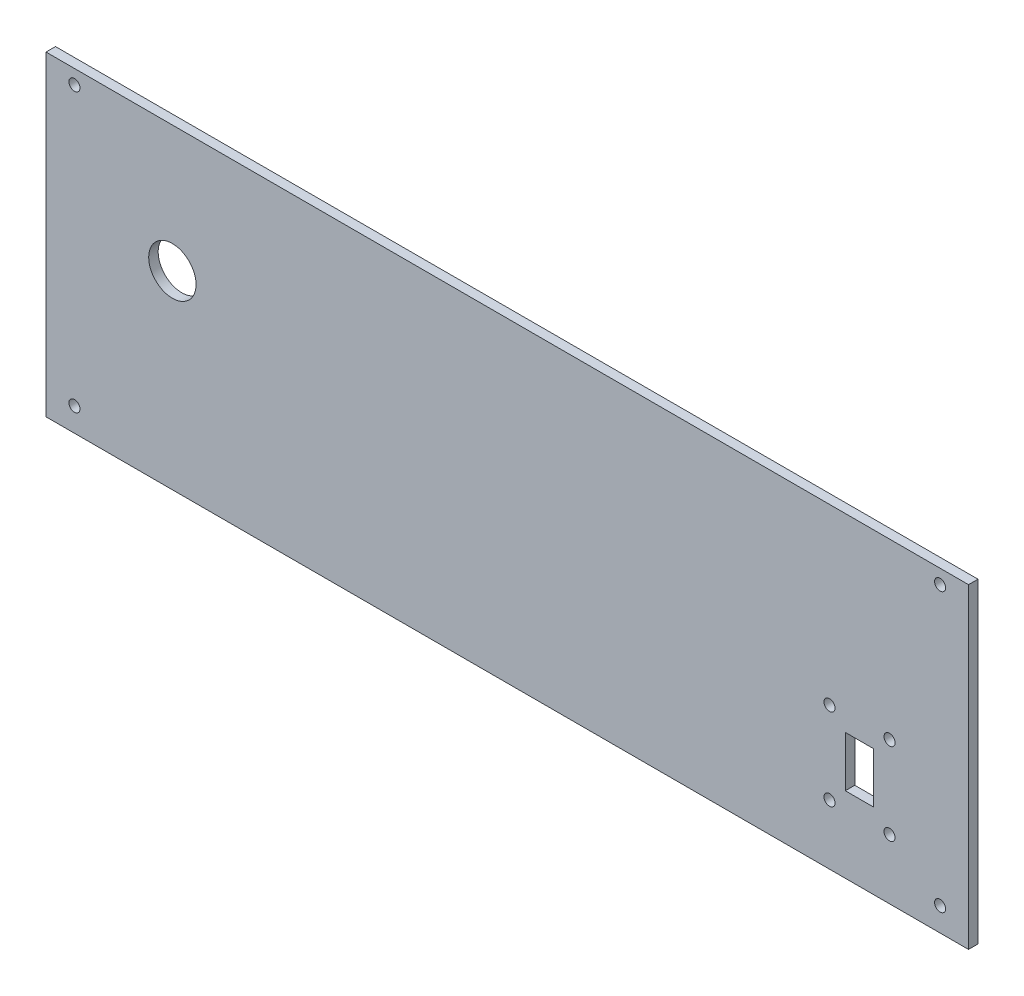
ISO-10303-21;
HEADER;
FILE_DESCRIPTION(('STEP AP214'),'2;1');
FILE_NAME('part.step','',(''),(''),'','','');
FILE_SCHEMA(('AUTOMOTIVE_DESIGN { 1 0 10303 214 1 1 1 1 }'));
ENDSEC;
DATA;
#1=APPLICATION_CONTEXT('core data for automotive mechanical design processes');
#2=APPLICATION_PROTOCOL_DEFINITION('international standard','automotive_design',2000,#1);
#3=PRODUCT_CONTEXT('',#1,'mechanical');
#4=PRODUCT('Part','Part','',(#3));
#5=PRODUCT_RELATED_PRODUCT_CATEGORY('part','',(#4));
#6=PRODUCT_DEFINITION_FORMATION('','',#4);
#7=PRODUCT_DEFINITION_CONTEXT('part definition',#1,'design');
#8=PRODUCT_DEFINITION('design','',#6,#7);
#9=PRODUCT_DEFINITION_SHAPE('','',#8);
#10=(LENGTH_UNIT() NAMED_UNIT(*) SI_UNIT(.MILLI.,.METRE.));
#11=(NAMED_UNIT(*) PLANE_ANGLE_UNIT() SI_UNIT($,.RADIAN.));
#12=(NAMED_UNIT(*) SI_UNIT($,.STERADIAN.) SOLID_ANGLE_UNIT());
#13=UNCERTAINTY_MEASURE_WITH_UNIT(LENGTH_MEASURE(1.E-05),#10,'distance_accuracy_value','');
#14=(GEOMETRIC_REPRESENTATION_CONTEXT(3) GLOBAL_UNCERTAINTY_ASSIGNED_CONTEXT((#13)) GLOBAL_UNIT_ASSIGNED_CONTEXT((#10,
#11,#12)) REPRESENTATION_CONTEXT('',''));
#15=CARTESIAN_POINT('',(0.,0.,0.));
#16=DIRECTION('',(0.,0.,1.));
#17=DIRECTION('',(1.,0.,0.));
#18=AXIS2_PLACEMENT_3D('',#15,#16,#17);
#19=CARTESIAN_POINT('',(0.,0.,3.));
#20=DIRECTION('',(0.,1.,0.));
#21=DIRECTION('',(0.,0.,1.));
#22=AXIS2_PLACEMENT_3D('',#19,#20,#21);
#23=PLANE('',#22);
#24=DIRECTION('',(1.,0.,0.));
#25=VECTOR('',#24,1.);
#26=CARTESIAN_POINT('',(0.,0.,3.));
#27=LINE('',#26,#25);
#28=CARTESIAN_POINT('',(7.99999999999999,0.,3.));
#29=VERTEX_POINT('',#28);
#30=CARTESIAN_POINT('',(300.,0.,3.));
#31=VERTEX_POINT('',#30);
#32=EDGE_CURVE('E177',#29,#31,#27,.T.);
#33=ORIENTED_EDGE('',*,*,#32,.F.);
#34=DIRECTION('',(0.,0.,-1.));
#35=VECTOR('',#34,1.);
#36=CARTESIAN_POINT('',(7.99999999999999,0.,10.));
#37=LINE('',#36,#35);
#38=CARTESIAN_POINT('',(7.99999999999999,0.,0.));
#39=VERTEX_POINT('',#38);
#40=EDGE_CURVE('E169',#29,#39,#37,.T.);
#41=ORIENTED_EDGE('',*,*,#40,.T.);
#42=DIRECTION('',(1.,0.,0.));
#43=VECTOR('',#42,1.);
#44=CARTESIAN_POINT('',(0.,0.,0.));
#45=LINE('',#44,#43);
#46=CARTESIAN_POINT('',(300.,0.,0.));
#47=VERTEX_POINT('',#46);
#48=EDGE_CURVE('E176',#39,#47,#45,.T.);
#49=ORIENTED_EDGE('',*,*,#48,.T.);
#50=DIRECTION('',(0.,0.,-1.));
#51=VECTOR('',#50,1.);
#52=CARTESIAN_POINT('',(300.,0.,3.));
#53=LINE('',#52,#51);
#54=EDGE_CURVE('E11',#31,#47,#53,.T.);
#55=ORIENTED_EDGE('',*,*,#54,.F.);
#56=EDGE_LOOP('',(#33,#41,#49,#55));
#57=FACE_BOUND('',#56,.T.);
#58=ADVANCED_FACE('F35',(#57),#23,.F.);
#59=CARTESIAN_POINT('',(300.,0.,3.));
#60=DIRECTION('',(-1.,0.,0.));
#61=DIRECTION('',(0.,0.,1.));
#62=AXIS2_PLACEMENT_3D('',#59,#60,#61);
#63=PLANE('',#62);
#64=DIRECTION('',(0.,1.,0.));
#65=VECTOR('',#64,1.);
#66=CARTESIAN_POINT('',(300.,0.,0.));
#67=LINE('',#66,#65);
#68=CARTESIAN_POINT('',(300.,100.,0.));
#69=VERTEX_POINT('',#68);
#70=EDGE_CURVE('E186',#47,#69,#67,.T.);
#71=ORIENTED_EDGE('',*,*,#70,.T.);
#72=DIRECTION('',(0.,0.,-1.));
#73=VECTOR('',#72,1.);
#74=CARTESIAN_POINT('',(300.,100.,3.));
#75=LINE('',#74,#73);
#76=CARTESIAN_POINT('',(300.,100.,3.));
#77=VERTEX_POINT('',#76);
#78=EDGE_CURVE('E42',#77,#69,#75,.T.);
#79=ORIENTED_EDGE('',*,*,#78,.F.);
#80=DIRECTION('',(0.,1.,0.));
#81=VECTOR('',#80,1.);
#82=CARTESIAN_POINT('',(300.,0.,3.));
#83=LINE('',#82,#81);
#84=EDGE_CURVE('E179',#31,#77,#83,.T.);
#85=ORIENTED_EDGE('',*,*,#84,.F.);
#86=ORIENTED_EDGE('',*,*,#54,.T.);
#87=EDGE_LOOP('',(#71,#79,#85,#86));
#88=FACE_BOUND('',#87,.T.);
#89=ADVANCED_FACE('F209',(#88),#63,.F.);
#90=CARTESIAN_POINT('',(0.,100.,3.));
#91=DIRECTION('',(0.,-1.,0.));
#92=DIRECTION('',(0.,0.,-1.));
#93=AXIS2_PLACEMENT_3D('',#90,#91,#92);
#94=PLANE('',#93);
#95=DIRECTION('',(-1.,0.,0.));
#96=VECTOR('',#95,1.);
#97=CARTESIAN_POINT('',(0.,100.,0.));
#98=LINE('',#97,#96);
#99=CARTESIAN_POINT('',(8.,100.,0.));
#100=VERTEX_POINT('',#99);
#101=EDGE_CURVE('E180',#69,#100,#98,.T.);
#102=ORIENTED_EDGE('',*,*,#101,.T.);
#103=DIRECTION('',(0.,0.,-1.));
#104=VECTOR('',#103,1.);
#105=CARTESIAN_POINT('',(8.,100.,10.));
#106=LINE('',#105,#104);
#107=CARTESIAN_POINT('',(8.,100.,3.));
#108=VERTEX_POINT('',#107);
#109=EDGE_CURVE('E168',#108,#100,#106,.T.);
#110=ORIENTED_EDGE('',*,*,#109,.F.);
#111=DIRECTION('',(-1.,0.,0.));
#112=VECTOR('',#111,1.);
#113=CARTESIAN_POINT('',(0.,100.,3.));
#114=LINE('',#113,#112);
#115=EDGE_CURVE('E182',#77,#108,#114,.T.);
#116=ORIENTED_EDGE('',*,*,#115,.F.);
#117=ORIENTED_EDGE('',*,*,#78,.T.);
#118=EDGE_LOOP('',(#102,#110,#116,#117));
#119=FACE_BOUND('',#118,.T.);
#120=ADVANCED_FACE('F194',(#119),#94,.F.);
#121=CARTESIAN_POINT('',(0.,0.,3.));
#122=DIRECTION('',(0.,0.,-1.));
#123=DIRECTION('',(-1.,0.,0.));
#124=AXIS2_PLACEMENT_3D('',#121,#122,#123);
#125=PLANE('',#124);
#126=CARTESIAN_POINT('',(275.,45.,3.));
#127=DIRECTION('',(0.,0.,-1.));
#128=DIRECTION('',(-1.,0.,0.));
#129=AXIS2_PLACEMENT_3D('',#126,#127,#128);
#130=CIRCLE('',#129,1.74999999999998);
#131=CARTESIAN_POINT('',(273.25,45.,3.));
#132=VERTEX_POINT('',#131);
#133=EDGE_CURVE('E279',#132,#132,#130,.T.);
#134=ORIENTED_EDGE('',*,*,#133,.T.);
#135=EDGE_LOOP('',(#134));
#136=FACE_BOUND('',#135,.T.);
#137=CARTESIAN_POINT('',(275.,19.,3.));
#138=DIRECTION('',(0.,0.,-1.));
#139=DIRECTION('',(-1.,0.,0.));
#140=AXIS2_PLACEMENT_3D('',#137,#138,#139);
#141=CIRCLE('',#140,1.74999999999998);
#142=CARTESIAN_POINT('',(273.25,19.,3.));
#143=VERTEX_POINT('',#142);
#144=EDGE_CURVE('E280',#143,#143,#141,.T.);
#145=ORIENTED_EDGE('',*,*,#144,.T.);
#146=EDGE_LOOP('',(#145));
#147=FACE_BOUND('',#146,.T.);
#148=CARTESIAN_POINT('',(256.,19.,3.));
#149=DIRECTION('',(0.,0.,-1.));
#150=DIRECTION('',(-1.,0.,0.));
#151=AXIS2_PLACEMENT_3D('',#148,#149,#150);
#152=CIRCLE('',#151,1.74999999999998);
#153=CARTESIAN_POINT('',(254.25,19.,3.));
#154=VERTEX_POINT('',#153);
#155=EDGE_CURVE('E283',#154,#154,#152,.T.);
#156=ORIENTED_EDGE('',*,*,#155,.T.);
#157=EDGE_LOOP('',(#156));
#158=FACE_BOUND('',#157,.T.);
#159=CARTESIAN_POINT('',(256.,45.,3.));
#160=DIRECTION('',(0.,0.,-1.));
#161=DIRECTION('',(-1.,0.,0.));
#162=AXIS2_PLACEMENT_3D('',#159,#160,#161);
#163=CIRCLE('',#162,1.74999999999998);
#164=CARTESIAN_POINT('',(254.25,45.,3.));
#165=VERTEX_POINT('',#164);
#166=EDGE_CURVE('E288',#165,#165,#163,.T.);
#167=ORIENTED_EDGE('',*,*,#166,.T.);
#168=EDGE_LOOP('',(#167));
#169=FACE_BOUND('',#168,.T.);
#170=DIRECTION('',(-1.,0.,0.));
#171=VECTOR('',#170,1.);
#172=CARTESIAN_POINT('',(0.,24.,3.));
#173=LINE('',#172,#171);
#174=CARTESIAN_POINT('',(270.,24.,3.));
#175=VERTEX_POINT('',#174);
#176=CARTESIAN_POINT('',(261.,24.,3.));
#177=VERTEX_POINT('',#176);
#178=EDGE_CURVE('E130',#175,#177,#173,.T.);
#179=ORIENTED_EDGE('',*,*,#178,.T.);
#180=DIRECTION('',(0.,1.,0.));
#181=VECTOR('',#180,1.);
#182=CARTESIAN_POINT('',(261.,0.,3.));
#183=LINE('',#182,#181);
#184=CARTESIAN_POINT('',(261.,40.,3.));
#185=VERTEX_POINT('',#184);
#186=EDGE_CURVE('E133',#177,#185,#183,.T.);
#187=ORIENTED_EDGE('',*,*,#186,.T.);
#188=DIRECTION('',(1.,0.,0.));
#189=VECTOR('',#188,1.);
#190=CARTESIAN_POINT('',(0.,40.,3.));
#191=LINE('',#190,#189);
#192=CARTESIAN_POINT('',(270.,40.,3.));
#193=VERTEX_POINT('',#192);
#194=EDGE_CURVE('E125',#185,#193,#191,.T.);
#195=ORIENTED_EDGE('',*,*,#194,.T.);
#196=DIRECTION('',(0.,-1.,0.));
#197=VECTOR('',#196,1.);
#198=CARTESIAN_POINT('',(270.,0.,3.));
#199=LINE('',#198,#197);
#200=EDGE_CURVE('E105',#193,#175,#199,.T.);
#201=ORIENTED_EDGE('',*,*,#200,.T.);
#202=EDGE_LOOP('',(#179,#187,#195,#201));
#203=FACE_BOUND('',#202,.T.);
#204=CARTESIAN_POINT('',(48.,60.,3.));
#205=DIRECTION('',(0.,0.,-1.));
#206=DIRECTION('',(-1.,0.,0.));
#207=AXIS2_PLACEMENT_3D('',#204,#205,#206);
#208=CIRCLE('',#207,7.5);
#209=CARTESIAN_POINT('',(40.5,60.,3.));
#210=VERTEX_POINT('',#209);
#211=EDGE_CURVE('E139',#210,#210,#208,.T.);
#212=ORIENTED_EDGE('',*,*,#211,.T.);
#213=EDGE_LOOP('',(#212));
#214=FACE_BOUND('',#213,.T.);
#215=CARTESIAN_POINT('',(17.,95.5,3.));
#216=DIRECTION('',(0.,0.,-1.));
#217=DIRECTION('',(1.,0.,0.));
#218=AXIS2_PLACEMENT_3D('',#215,#216,#217);
#219=CIRCLE('',#218,1.74999999999998);
#220=CARTESIAN_POINT('',(18.75,95.5,3.));
#221=VERTEX_POINT('',#220);
#222=EDGE_CURVE('E143',#221,#221,#219,.T.);
#223=ORIENTED_EDGE('',*,*,#222,.T.);
#224=EDGE_LOOP('',(#223));
#225=FACE_BOUND('',#224,.T.);
#226=CARTESIAN_POINT('',(17.,7.49999999999998,3.));
#227=DIRECTION('',(0.,0.,-1.));
#228=DIRECTION('',(-1.,0.,0.));
#229=AXIS2_PLACEMENT_3D('',#226,#227,#228);
#230=CIRCLE('',#229,1.74999999999998);
#231=CARTESIAN_POINT('',(15.25,7.49999999999998,3.));
#232=VERTEX_POINT('',#231);
#233=EDGE_CURVE('E150',#232,#232,#230,.T.);
#234=ORIENTED_EDGE('',*,*,#233,.T.);
#235=EDGE_LOOP('',(#234));
#236=FACE_BOUND('',#235,.T.);
#237=CARTESIAN_POINT('',(291.,7.49999999999994,3.));
#238=DIRECTION('',(0.,0.,-1.));
#239=DIRECTION('',(1.,0.,0.));
#240=AXIS2_PLACEMENT_3D('',#237,#238,#239);
#241=CIRCLE('',#240,1.74999999999998);
#242=CARTESIAN_POINT('',(292.75,7.49999999999994,3.));
#243=VERTEX_POINT('',#242);
#244=EDGE_CURVE('E156',#243,#243,#241,.T.);
#245=ORIENTED_EDGE('',*,*,#244,.T.);
#246=EDGE_LOOP('',(#245));
#247=FACE_BOUND('',#246,.T.);
#248=CARTESIAN_POINT('',(291.,95.5,3.));
#249=DIRECTION('',(0.,0.,-1.));
#250=DIRECTION('',(-1.,0.,0.));
#251=AXIS2_PLACEMENT_3D('',#248,#249,#250);
#252=CIRCLE('',#251,1.74999999999998);
#253=CARTESIAN_POINT('',(289.25,95.5,3.));
#254=VERTEX_POINT('',#253);
#255=EDGE_CURVE('E161',#254,#254,#252,.T.);
#256=ORIENTED_EDGE('',*,*,#255,.T.);
#257=EDGE_LOOP('',(#256));
#258=FACE_BOUND('',#257,.T.);
#259=ORIENTED_EDGE('',*,*,#115,.T.);
#260=DIRECTION('',(0.,-1.,0.));
#261=VECTOR('',#260,1.);
#262=CARTESIAN_POINT('',(7.99999999999999,0.,3.));
#263=LINE('',#262,#261);
#264=EDGE_CURVE('E172',#108,#29,#263,.T.);
#265=ORIENTED_EDGE('',*,*,#264,.T.);
#266=ORIENTED_EDGE('',*,*,#32,.T.);
#267=ORIENTED_EDGE('',*,*,#84,.T.);
#268=EDGE_LOOP('',(#259,#265,#266,#267));
#269=FACE_BOUND('',#268,.T.);
#270=ADVANCED_FACE('F208',(#136,#147,#158,#169,#203,#214,#225,#236,#247,#258,#269),#125,.F.);
#271=CARTESIAN_POINT('',(0.,0.,0.));
#272=DIRECTION('',(0.,0.,-1.));
#273=DIRECTION('',(-1.,0.,0.));
#274=AXIS2_PLACEMENT_3D('',#271,#272,#273);
#275=PLANE('',#274);
#276=CARTESIAN_POINT('',(275.,45.,0.));
#277=DIRECTION('',(0.,0.,-1.));
#278=DIRECTION('',(-1.,0.,0.));
#279=AXIS2_PLACEMENT_3D('',#276,#277,#278);
#280=CIRCLE('',#279,1.74999999999998);
#281=CARTESIAN_POINT('',(273.25,45.,0.));
#282=VERTEX_POINT('',#281);
#283=EDGE_CURVE('E276',#282,#282,#280,.T.);
#284=ORIENTED_EDGE('',*,*,#283,.F.);
#285=EDGE_LOOP('',(#284));
#286=FACE_BOUND('',#285,.T.);
#287=CARTESIAN_POINT('',(275.,19.,0.));
#288=DIRECTION('',(0.,0.,-1.));
#289=DIRECTION('',(1.,0.,0.));
#290=AXIS2_PLACEMENT_3D('',#287,#288,#289);
#291=CIRCLE('',#290,1.74999999999998);
#292=CARTESIAN_POINT('',(276.75,19.,0.));
#293=VERTEX_POINT('',#292);
#294=EDGE_CURVE('E297',#293,#293,#291,.T.);
#295=ORIENTED_EDGE('',*,*,#294,.F.);
#296=EDGE_LOOP('',(#295));
#297=FACE_BOUND('',#296,.T.);
#298=CARTESIAN_POINT('',(256.,19.,0.));
#299=DIRECTION('',(0.,0.,-1.));
#300=DIRECTION('',(-1.,0.,0.));
#301=AXIS2_PLACEMENT_3D('',#298,#299,#300);
#302=CIRCLE('',#301,1.74999999999998);
#303=CARTESIAN_POINT('',(254.25,19.,0.));
#304=VERTEX_POINT('',#303);
#305=EDGE_CURVE('E294',#304,#304,#302,.T.);
#306=ORIENTED_EDGE('',*,*,#305,.F.);
#307=EDGE_LOOP('',(#306));
#308=FACE_BOUND('',#307,.T.);
#309=CARTESIAN_POINT('',(256.,45.,0.));
#310=DIRECTION('',(0.,0.,-1.));
#311=DIRECTION('',(1.,0.,0.));
#312=AXIS2_PLACEMENT_3D('',#309,#310,#311);
#313=CIRCLE('',#312,1.74999999999998);
#314=CARTESIAN_POINT('',(257.75,45.,0.));
#315=VERTEX_POINT('',#314);
#316=EDGE_CURVE('E291',#315,#315,#313,.T.);
#317=ORIENTED_EDGE('',*,*,#316,.F.);
#318=EDGE_LOOP('',(#317));
#319=FACE_BOUND('',#318,.T.);
#320=DIRECTION('',(0.,1.,0.));
#321=VECTOR('',#320,1.);
#322=CARTESIAN_POINT('',(261.,24.,0.));
#323=LINE('',#322,#321);
#324=CARTESIAN_POINT('',(261.,24.,0.));
#325=VERTEX_POINT('',#324);
#326=CARTESIAN_POINT('',(261.,40.,0.));
#327=VERTEX_POINT('',#326);
#328=EDGE_CURVE('E57',#325,#327,#323,.T.);
#329=ORIENTED_EDGE('',*,*,#328,.F.);
#330=DIRECTION('',(-1.,0.,0.));
#331=VECTOR('',#330,1.);
#332=CARTESIAN_POINT('',(261.,24.,0.));
#333=LINE('',#332,#331);
#334=CARTESIAN_POINT('',(270.,24.,0.));
#335=VERTEX_POINT('',#334);
#336=EDGE_CURVE('E118',#335,#325,#333,.T.);
#337=ORIENTED_EDGE('',*,*,#336,.F.);
#338=DIRECTION('',(0.,-1.,0.));
#339=VECTOR('',#338,1.);
#340=CARTESIAN_POINT('',(270.,24.,0.));
#341=LINE('',#340,#339);
#342=CARTESIAN_POINT('',(270.,40.,0.));
#343=VERTEX_POINT('',#342);
#344=EDGE_CURVE('E102',#343,#335,#341,.T.);
#345=ORIENTED_EDGE('',*,*,#344,.F.);
#346=DIRECTION('',(1.,0.,0.));
#347=VECTOR('',#346,1.);
#348=CARTESIAN_POINT('',(261.,40.,0.));
#349=LINE('',#348,#347);
#350=EDGE_CURVE('E111',#327,#343,#349,.T.);
#351=ORIENTED_EDGE('',*,*,#350,.F.);
#352=EDGE_LOOP('',(#329,#337,#345,#351));
#353=FACE_BOUND('',#352,.T.);
#354=CARTESIAN_POINT('',(48.,60.,0.));
#355=DIRECTION('',(0.,0.,-1.));
#356=DIRECTION('',(-1.,0.,0.));
#357=AXIS2_PLACEMENT_3D('',#354,#355,#356);
#358=CIRCLE('',#357,7.5);
#359=CARTESIAN_POINT('',(40.5,60.,0.));
#360=VERTEX_POINT('',#359);
#361=EDGE_CURVE('E136',#360,#360,#358,.T.);
#362=ORIENTED_EDGE('',*,*,#361,.F.);
#363=EDGE_LOOP('',(#362));
#364=FACE_BOUND('',#363,.T.);
#365=CARTESIAN_POINT('',(17.,95.5,0.));
#366=DIRECTION('',(0.,0.,-1.));
#367=DIRECTION('',(1.,0.,0.));
#368=AXIS2_PLACEMENT_3D('',#365,#366,#367);
#369=CIRCLE('',#368,1.74999999999998);
#370=CARTESIAN_POINT('',(18.75,95.5,0.));
#371=VERTEX_POINT('',#370);
#372=EDGE_CURVE('E147',#371,#371,#369,.T.);
#373=ORIENTED_EDGE('',*,*,#372,.F.);
#374=EDGE_LOOP('',(#373));
#375=FACE_BOUND('',#374,.T.);
#376=CARTESIAN_POINT('',(17.,7.49999999999998,0.));
#377=DIRECTION('',(0.,0.,-1.));
#378=DIRECTION('',(-1.,0.,0.));
#379=AXIS2_PLACEMENT_3D('',#376,#377,#378);
#380=CIRCLE('',#379,1.74999999999998);
#381=CARTESIAN_POINT('',(15.25,7.49999999999998,0.));
#382=VERTEX_POINT('',#381);
#383=EDGE_CURVE('E153',#382,#382,#380,.T.);
#384=ORIENTED_EDGE('',*,*,#383,.F.);
#385=EDGE_LOOP('',(#384));
#386=FACE_BOUND('',#385,.T.);
#387=CARTESIAN_POINT('',(291.,7.49999999999994,0.));
#388=DIRECTION('',(0.,0.,-1.));
#389=DIRECTION('',(1.,0.,0.));
#390=AXIS2_PLACEMENT_3D('',#387,#388,#389);
#391=CIRCLE('',#390,1.74999999999998);
#392=CARTESIAN_POINT('',(292.75,7.49999999999994,0.));
#393=VERTEX_POINT('',#392);
#394=EDGE_CURVE('E142',#393,#393,#391,.T.);
#395=ORIENTED_EDGE('',*,*,#394,.F.);
#396=EDGE_LOOP('',(#395));
#397=FACE_BOUND('',#396,.T.);
#398=CARTESIAN_POINT('',(291.,95.5,0.));
#399=DIRECTION('',(0.,0.,-1.));
#400=DIRECTION('',(-1.,0.,0.));
#401=AXIS2_PLACEMENT_3D('',#398,#399,#400);
#402=CIRCLE('',#401,1.74999999999998);
#403=CARTESIAN_POINT('',(289.25,95.5,0.));
#404=VERTEX_POINT('',#403);
#405=EDGE_CURVE('E146',#404,#404,#402,.T.);
#406=ORIENTED_EDGE('',*,*,#405,.F.);
#407=EDGE_LOOP('',(#406));
#408=FACE_BOUND('',#407,.T.);
#409=DIRECTION('',(0.,-1.,0.));
#410=VECTOR('',#409,1.);
#411=CARTESIAN_POINT('',(8.,100.,0.));
#412=LINE('',#411,#410);
#413=EDGE_CURVE('E164',#100,#39,#412,.T.);
#414=ORIENTED_EDGE('',*,*,#413,.F.);
#415=ORIENTED_EDGE('',*,*,#101,.F.);
#416=ORIENTED_EDGE('',*,*,#70,.F.);
#417=ORIENTED_EDGE('',*,*,#48,.F.);
#418=EDGE_LOOP('',(#414,#415,#416,#417));
#419=FACE_BOUND('',#418,.T.);
#420=ADVANCED_FACE('F115',(#286,#297,#308,#319,#353,#364,#375,#386,#397,#408,#419),#275,.T.);
#421=CARTESIAN_POINT('',(8.,100.,10.));
#422=DIRECTION('',(1.,0.,0.));
#423=DIRECTION('',(0.,1.,0.));
#424=AXIS2_PLACEMENT_3D('',#421,#422,#423);
#425=PLANE('',#424);
#426=ORIENTED_EDGE('',*,*,#109,.T.);
#427=ORIENTED_EDGE('',*,*,#413,.T.);
#428=ORIENTED_EDGE('',*,*,#40,.F.);
#429=ORIENTED_EDGE('',*,*,#264,.F.);
#430=EDGE_LOOP('',(#426,#427,#428,#429));
#431=FACE_BOUND('',#430,.T.);
#432=ADVANCED_FACE('F203',(#431),#425,.F.);
#433=CARTESIAN_POINT('',(291.,95.5,3.));
#434=DIRECTION('',(0.,0.,-1.));
#435=DIRECTION('',(-1.,0.,0.));
#436=AXIS2_PLACEMENT_3D('',#433,#434,#435);
#437=CYLINDRICAL_SURFACE('',#436,1.74999999999998);
#438=ORIENTED_EDGE('',*,*,#255,.F.);
#439=EDGE_LOOP('',(#438));
#440=FACE_BOUND('',#439,.T.);
#441=ORIENTED_EDGE('',*,*,#405,.T.);
#442=EDGE_LOOP('',(#441));
#443=FACE_BOUND('',#442,.T.);
#444=ADVANCED_FACE('F225',(#440,#443),#437,.F.);
#445=CARTESIAN_POINT('',(291.,7.49999999999994,3.));
#446=DIRECTION('',(0.,0.,-1.));
#447=DIRECTION('',(-1.,0.,0.));
#448=AXIS2_PLACEMENT_3D('',#445,#446,#447);
#449=CYLINDRICAL_SURFACE('',#448,1.74999999999998);
#450=ORIENTED_EDGE('',*,*,#244,.F.);
#451=EDGE_LOOP('',(#450));
#452=FACE_BOUND('',#451,.T.);
#453=ORIENTED_EDGE('',*,*,#394,.T.);
#454=EDGE_LOOP('',(#453));
#455=FACE_BOUND('',#454,.T.);
#456=ADVANCED_FACE('F228',(#452,#455),#449,.F.);
#457=CARTESIAN_POINT('',(17.,7.49999999999998,3.));
#458=DIRECTION('',(0.,0.,-1.));
#459=DIRECTION('',(-1.,0.,0.));
#460=AXIS2_PLACEMENT_3D('',#457,#458,#459);
#461=CYLINDRICAL_SURFACE('',#460,1.74999999999998);
#462=ORIENTED_EDGE('',*,*,#233,.F.);
#463=EDGE_LOOP('',(#462));
#464=FACE_BOUND('',#463,.T.);
#465=ORIENTED_EDGE('',*,*,#383,.T.);
#466=EDGE_LOOP('',(#465));
#467=FACE_BOUND('',#466,.T.);
#468=ADVANCED_FACE('F232',(#464,#467),#461,.F.);
#469=CARTESIAN_POINT('',(17.,95.5,3.));
#470=DIRECTION('',(0.,0.,-1.));
#471=DIRECTION('',(-1.,0.,0.));
#472=AXIS2_PLACEMENT_3D('',#469,#470,#471);
#473=CYLINDRICAL_SURFACE('',#472,1.74999999999998);
#474=ORIENTED_EDGE('',*,*,#222,.F.);
#475=EDGE_LOOP('',(#474));
#476=FACE_BOUND('',#475,.T.);
#477=ORIENTED_EDGE('',*,*,#372,.T.);
#478=EDGE_LOOP('',(#477));
#479=FACE_BOUND('',#478,.T.);
#480=ADVANCED_FACE('F236',(#476,#479),#473,.F.);
#481=CARTESIAN_POINT('',(48.,60.,10.));
#482=DIRECTION('',(0.,0.,-1.));
#483=DIRECTION('',(-1.,0.,0.));
#484=AXIS2_PLACEMENT_3D('',#481,#482,#483);
#485=CYLINDRICAL_SURFACE('',#484,7.5);
#486=ORIENTED_EDGE('',*,*,#361,.T.);
#487=EDGE_LOOP('',(#486));
#488=FACE_BOUND('',#487,.T.);
#489=ORIENTED_EDGE('',*,*,#211,.F.);
#490=EDGE_LOOP('',(#489));
#491=FACE_BOUND('',#490,.T.);
#492=ADVANCED_FACE('F240',(#488,#491),#485,.F.);
#493=CARTESIAN_POINT('',(261.,24.,10.));
#494=DIRECTION('',(-1.,0.,0.));
#495=DIRECTION('',(0.,0.,1.));
#496=AXIS2_PLACEMENT_3D('',#493,#494,#495);
#497=PLANE('',#496);
#498=DIRECTION('',(0.,0.,-1.));
#499=VECTOR('',#498,1.);
#500=CARTESIAN_POINT('',(261.,24.,10.));
#501=LINE('',#500,#499);
#502=EDGE_CURVE('E123',#177,#325,#501,.T.);
#503=ORIENTED_EDGE('',*,*,#502,.T.);
#504=ORIENTED_EDGE('',*,*,#328,.T.);
#505=DIRECTION('',(0.,0.,-1.));
#506=VECTOR('',#505,1.);
#507=CARTESIAN_POINT('',(261.,40.,10.));
#508=LINE('',#507,#506);
#509=EDGE_CURVE('E108',#185,#327,#508,.T.);
#510=ORIENTED_EDGE('',*,*,#509,.F.);
#511=ORIENTED_EDGE('',*,*,#186,.F.);
#512=EDGE_LOOP('',(#503,#504,#510,#511));
#513=FACE_BOUND('',#512,.T.);
#514=ADVANCED_FACE('F244',(#513),#497,.F.);
#515=CARTESIAN_POINT('',(261.,24.,10.));
#516=DIRECTION('',(0.,-1.,0.));
#517=DIRECTION('',(0.,0.,-1.));
#518=AXIS2_PLACEMENT_3D('',#515,#516,#517);
#519=PLANE('',#518);
#520=DIRECTION('',(0.,0.,-1.));
#521=VECTOR('',#520,1.);
#522=CARTESIAN_POINT('',(270.,24.,10.));
#523=LINE('',#522,#521);
#524=EDGE_CURVE('E107',#175,#335,#523,.T.);
#525=ORIENTED_EDGE('',*,*,#524,.T.);
#526=ORIENTED_EDGE('',*,*,#336,.T.);
#527=ORIENTED_EDGE('',*,*,#502,.F.);
#528=ORIENTED_EDGE('',*,*,#178,.F.);
#529=EDGE_LOOP('',(#525,#526,#527,#528));
#530=FACE_BOUND('',#529,.T.);
#531=ADVANCED_FACE('F248',(#530),#519,.F.);
#532=CARTESIAN_POINT('',(270.,24.,10.));
#533=DIRECTION('',(1.,0.,0.));
#534=DIRECTION('',(0.,0.,-1.));
#535=AXIS2_PLACEMENT_3D('',#532,#533,#534);
#536=PLANE('',#535);
#537=DIRECTION('',(0.,0.,-1.));
#538=VECTOR('',#537,1.);
#539=CARTESIAN_POINT('',(270.,40.,10.));
#540=LINE('',#539,#538);
#541=EDGE_CURVE('E49',#193,#343,#540,.T.);
#542=ORIENTED_EDGE('',*,*,#541,.T.);
#543=ORIENTED_EDGE('',*,*,#344,.T.);
#544=ORIENTED_EDGE('',*,*,#524,.F.);
#545=ORIENTED_EDGE('',*,*,#200,.F.);
#546=EDGE_LOOP('',(#542,#543,#544,#545));
#547=FACE_BOUND('',#546,.T.);
#548=ADVANCED_FACE('F99',(#547),#536,.F.);
#549=CARTESIAN_POINT('',(261.,40.,10.));
#550=DIRECTION('',(0.,1.,0.));
#551=DIRECTION('',(0.,0.,1.));
#552=AXIS2_PLACEMENT_3D('',#549,#550,#551);
#553=PLANE('',#552);
#554=ORIENTED_EDGE('',*,*,#509,.T.);
#555=ORIENTED_EDGE('',*,*,#350,.T.);
#556=ORIENTED_EDGE('',*,*,#541,.F.);
#557=ORIENTED_EDGE('',*,*,#194,.F.);
#558=EDGE_LOOP('',(#554,#555,#556,#557));
#559=FACE_BOUND('',#558,.T.);
#560=ADVANCED_FACE('F112',(#559),#553,.F.);
#561=CARTESIAN_POINT('',(256.,45.,10.));
#562=DIRECTION('',(0.,0.,-1.));
#563=DIRECTION('',(-1.,0.,0.));
#564=AXIS2_PLACEMENT_3D('',#561,#562,#563);
#565=CYLINDRICAL_SURFACE('',#564,1.74999999999998);
#566=ORIENTED_EDGE('',*,*,#316,.T.);
#567=EDGE_LOOP('',(#566));
#568=FACE_BOUND('',#567,.T.);
#569=ORIENTED_EDGE('',*,*,#166,.F.);
#570=EDGE_LOOP('',(#569));
#571=FACE_BOUND('',#570,.T.);
#572=ADVANCED_FACE('F251',(#568,#571),#565,.F.);
#573=CARTESIAN_POINT('',(256.,19.,10.));
#574=DIRECTION('',(0.,0.,-1.));
#575=DIRECTION('',(-1.,0.,0.));
#576=AXIS2_PLACEMENT_3D('',#573,#574,#575);
#577=CYLINDRICAL_SURFACE('',#576,1.74999999999998);
#578=ORIENTED_EDGE('',*,*,#305,.T.);
#579=EDGE_LOOP('',(#578));
#580=FACE_BOUND('',#579,.T.);
#581=ORIENTED_EDGE('',*,*,#155,.F.);
#582=EDGE_LOOP('',(#581));
#583=FACE_BOUND('',#582,.T.);
#584=ADVANCED_FACE('F259',(#580,#583),#577,.F.);
#585=CARTESIAN_POINT('',(275.,19.,10.));
#586=DIRECTION('',(0.,0.,-1.));
#587=DIRECTION('',(-1.,0.,0.));
#588=AXIS2_PLACEMENT_3D('',#585,#586,#587);
#589=CYLINDRICAL_SURFACE('',#588,1.74999999999998);
#590=ORIENTED_EDGE('',*,*,#294,.T.);
#591=EDGE_LOOP('',(#590));
#592=FACE_BOUND('',#591,.T.);
#593=ORIENTED_EDGE('',*,*,#144,.F.);
#594=EDGE_LOOP('',(#593));
#595=FACE_BOUND('',#594,.T.);
#596=ADVANCED_FACE('F263',(#592,#595),#589,.F.);
#597=CARTESIAN_POINT('',(275.,45.,10.));
#598=DIRECTION('',(0.,0.,-1.));
#599=DIRECTION('',(-1.,0.,0.));
#600=AXIS2_PLACEMENT_3D('',#597,#598,#599);
#601=CYLINDRICAL_SURFACE('',#600,1.74999999999998);
#602=ORIENTED_EDGE('',*,*,#283,.T.);
#603=EDGE_LOOP('',(#602));
#604=FACE_BOUND('',#603,.T.);
#605=ORIENTED_EDGE('',*,*,#133,.F.);
#606=EDGE_LOOP('',(#605));
#607=FACE_BOUND('',#606,.T.);
#608=ADVANCED_FACE('F267',(#604,#607),#601,.F.);
#609=CLOSED_SHELL('',(#58,#89,#120,#270,#420,#432,#444,#456,#468,#480,#492,#514,#531,#548,#560,
#572,#584,#596,#608));
#610=MANIFOLD_SOLID_BREP('B2',#609);
#611=ADVANCED_BREP_SHAPE_REPRESENTATION('',(#18,#610),#14);
#612=SHAPE_DEFINITION_REPRESENTATION(#9,#611);
ENDSEC;
END-ISO-10303-21;
